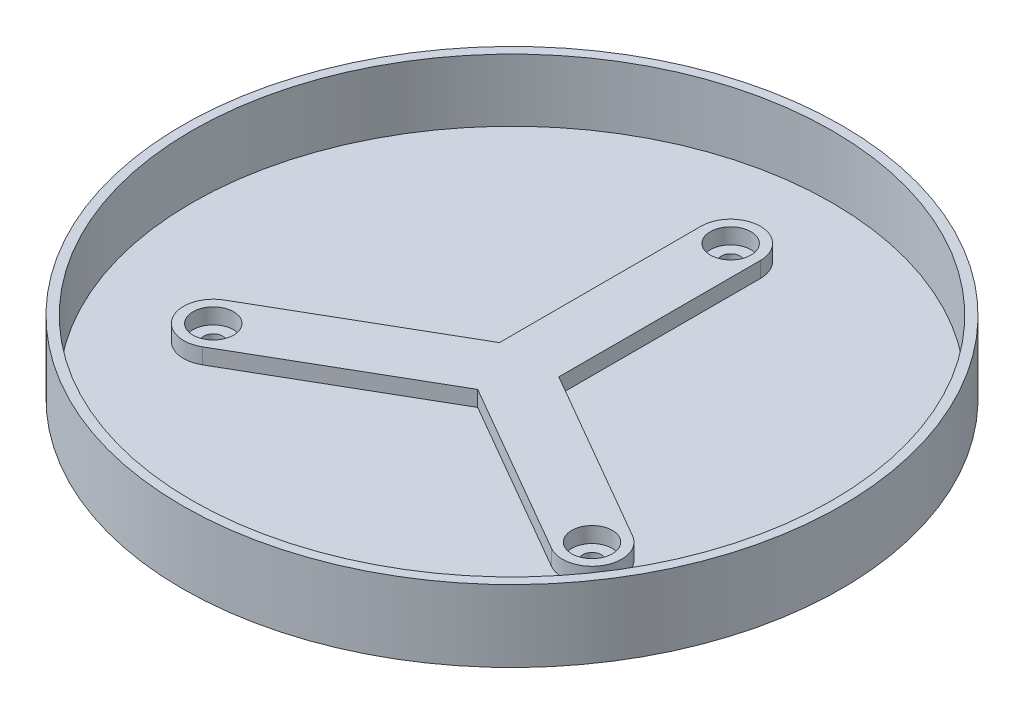
ISO-10303-21;
HEADER;
FILE_DESCRIPTION(('STEP AP214'),'2;1');
FILE_NAME('part.step','',(''),(''),'','','');
FILE_SCHEMA(('AUTOMOTIVE_DESIGN { 1 0 10303 214 1 1 1 1 }'));
ENDSEC;
DATA;
#1=APPLICATION_CONTEXT('core data for automotive mechanical design processes');
#2=APPLICATION_PROTOCOL_DEFINITION('international standard','automotive_design',2000,#1);
#3=PRODUCT_CONTEXT('',#1,'mechanical');
#4=PRODUCT('Part','Part','',(#3));
#5=PRODUCT_RELATED_PRODUCT_CATEGORY('part','',(#4));
#6=PRODUCT_DEFINITION_FORMATION('','',#4);
#7=PRODUCT_DEFINITION_CONTEXT('part definition',#1,'design');
#8=PRODUCT_DEFINITION('design','',#6,#7);
#9=PRODUCT_DEFINITION_SHAPE('','',#8);
#10=(LENGTH_UNIT() NAMED_UNIT(*) SI_UNIT(.MILLI.,.METRE.));
#11=(NAMED_UNIT(*) PLANE_ANGLE_UNIT() SI_UNIT($,.RADIAN.));
#12=(NAMED_UNIT(*) SI_UNIT($,.STERADIAN.) SOLID_ANGLE_UNIT());
#13=UNCERTAINTY_MEASURE_WITH_UNIT(LENGTH_MEASURE(1.E-05),#10,'distance_accuracy_value','');
#14=(GEOMETRIC_REPRESENTATION_CONTEXT(3) GLOBAL_UNCERTAINTY_ASSIGNED_CONTEXT((#13)) GLOBAL_UNIT_ASSIGNED_CONTEXT((#10,
#11,#12)) REPRESENTATION_CONTEXT('',''));
#15=CARTESIAN_POINT('',(0.,0.,0.));
#16=DIRECTION('',(0.,0.,1.));
#17=DIRECTION('',(1.,0.,0.));
#18=AXIS2_PLACEMENT_3D('',#15,#16,#17);
#19=CARTESIAN_POINT('',(0.,20.,0.));
#20=DIRECTION('',(0.,-1.,0.));
#21=DIRECTION('',(0.,0.,-1.));
#22=AXIS2_PLACEMENT_3D('',#19,#20,#21);
#23=CYLINDRICAL_SURFACE('',#22,105.5);
#24=CARTESIAN_POINT('',(0.,20.,0.));
#25=DIRECTION('',(0.,1.,0.));
#26=DIRECTION('',(0.,0.,1.));
#27=AXIS2_PLACEMENT_3D('',#24,#25,#26);
#28=CIRCLE('',#27,105.5);
#29=CARTESIAN_POINT('',(0.,20.,105.5));
#30=VERTEX_POINT('',#29);
#31=EDGE_CURVE('E193',#30,#30,#28,.T.);
#32=ORIENTED_EDGE('',*,*,#31,.F.);
#33=EDGE_LOOP('',(#32));
#34=FACE_BOUND('',#33,.T.);
#35=CARTESIAN_POINT('',(0.,-3.,0.));
#36=DIRECTION('',(0.,1.,0.));
#37=DIRECTION('',(0.,0.,1.));
#38=AXIS2_PLACEMENT_3D('',#35,#36,#37);
#39=CIRCLE('',#38,105.5);
#40=CARTESIAN_POINT('',(0.,-3.,105.5));
#41=VERTEX_POINT('',#40);
#42=EDGE_CURVE('E188',#41,#41,#39,.T.);
#43=ORIENTED_EDGE('',*,*,#42,.T.);
#44=EDGE_LOOP('',(#43));
#45=FACE_BOUND('',#44,.T.);
#46=ADVANCED_FACE('F35',(#34,#45),#23,.T.);
#47=CARTESIAN_POINT('',(0.,20.,0.));
#48=DIRECTION('',(0.,1.,0.));
#49=DIRECTION('',(0.,0.,1.));
#50=AXIS2_PLACEMENT_3D('',#47,#48,#49);
#51=PLANE('',#50);
#52=CARTESIAN_POINT('',(0.,20.,0.));
#53=DIRECTION('',(0.,1.,0.));
#54=DIRECTION('',(0.,0.,1.));
#55=AXIS2_PLACEMENT_3D('',#52,#53,#54);
#56=CIRCLE('',#55,102.5);
#57=CARTESIAN_POINT('',(0.,20.,102.5));
#58=VERTEX_POINT('',#57);
#59=EDGE_CURVE('E185',#58,#58,#56,.T.);
#60=ORIENTED_EDGE('',*,*,#59,.F.);
#61=EDGE_LOOP('',(#60));
#62=FACE_BOUND('',#61,.T.);
#63=ORIENTED_EDGE('',*,*,#31,.T.);
#64=EDGE_LOOP('',(#63));
#65=FACE_BOUND('',#64,.T.);
#66=ADVANCED_FACE('F236',(#62,#65),#51,.T.);
#67=CARTESIAN_POINT('',(0.,-3.,0.));
#68=DIRECTION('',(0.,1.,0.));
#69=DIRECTION('',(0.,0.,1.));
#70=AXIS2_PLACEMENT_3D('',#67,#68,#69);
#71=PLANE('',#70);
#72=CARTESIAN_POINT('',(0.,-3.,-70.));
#73=DIRECTION('',(0.,1.,0.));
#74=DIRECTION('',(0.,0.,1.));
#75=AXIS2_PLACEMENT_3D('',#72,#73,#74);
#76=CIRCLE('',#75,3.);
#77=CARTESIAN_POINT('',(0.,-3.,-67.));
#78=VERTEX_POINT('',#77);
#79=EDGE_CURVE('E204',#78,#78,#76,.T.);
#80=ORIENTED_EDGE('',*,*,#79,.T.);
#81=EDGE_LOOP('',(#80));
#82=FACE_BOUND('',#81,.T.);
#83=CARTESIAN_POINT('',(60.6217782649152,-3.,34.9999999999974));
#84=DIRECTION('',(0.,1.,0.));
#85=DIRECTION('',(0.,0.,1.));
#86=AXIS2_PLACEMENT_3D('',#83,#84,#85);
#87=CIRCLE('',#86,3.00000000000382);
#88=CARTESIAN_POINT('',(60.6217782649152,-3.,38.0000000000013));
#89=VERTEX_POINT('',#88);
#90=EDGE_CURVE('E306',#89,#89,#87,.T.);
#91=ORIENTED_EDGE('',*,*,#90,.T.);
#92=EDGE_LOOP('',(#91));
#93=FACE_BOUND('',#92,.T.);
#94=CARTESIAN_POINT('',(-60.6217782649063,-3.,35.0000000000026));
#95=DIRECTION('',(0.,1.,0.));
#96=DIRECTION('',(0.,0.,1.));
#97=AXIS2_PLACEMENT_3D('',#94,#95,#96);
#98=CIRCLE('',#97,3.00000000000564);
#99=CARTESIAN_POINT('',(-60.6217782649063,-3.,38.0000000000082));
#100=VERTEX_POINT('',#99);
#101=EDGE_CURVE('E308',#100,#100,#98,.T.);
#102=ORIENTED_EDGE('',*,*,#101,.T.);
#103=EDGE_LOOP('',(#102));
#104=FACE_BOUND('',#103,.T.);
#105=ORIENTED_EDGE('',*,*,#42,.F.);
#106=EDGE_LOOP('',(#105));
#107=FACE_BOUND('',#106,.T.);
#108=ADVANCED_FACE('F37',(#82,#93,#104,#107),#71,.F.);
#109=CARTESIAN_POINT('',(0.,20.,0.));
#110=DIRECTION('',(0.,-1.,0.));
#111=DIRECTION('',(0.,0.,-1.));
#112=AXIS2_PLACEMENT_3D('',#109,#110,#111);
#113=CYLINDRICAL_SURFACE('',#112,102.5);
#114=ORIENTED_EDGE('',*,*,#59,.T.);
#115=EDGE_LOOP('',(#114));
#116=FACE_BOUND('',#115,.T.);
#117=CARTESIAN_POINT('',(0.,0.,0.));
#118=DIRECTION('',(0.,1.,0.));
#119=DIRECTION('',(0.,0.,1.));
#120=AXIS2_PLACEMENT_3D('',#117,#118,#119);
#121=CIRCLE('',#120,102.5);
#122=CARTESIAN_POINT('',(0.,0.,102.5));
#123=VERTEX_POINT('',#122);
#124=EDGE_CURVE('E184',#123,#123,#121,.T.);
#125=ORIENTED_EDGE('',*,*,#124,.F.);
#126=EDGE_LOOP('',(#125));
#127=FACE_BOUND('',#126,.T.);
#128=ADVANCED_FACE('F246',(#116,#127),#113,.F.);
#129=CARTESIAN_POINT('',(0.,0.,0.));
#130=DIRECTION('',(0.,1.,0.));
#131=DIRECTION('',(0.,0.,1.));
#132=AXIS2_PLACEMENT_3D('',#129,#130,#131);
#133=PLANE('',#132);
#134=DIRECTION('',(0.866025403784436,0.,0.500000000000004));
#135=VECTOR('',#134,1.);
#136=CARTESIAN_POINT('',(-4.75000000000003,0.,8.22724133595214));
#137=LINE('',#136,#135);
#138=CARTESIAN_POINT('',(0.,0.,10.9696551146029));
#139=VERTEX_POINT('',#138);
#140=CARTESIAN_POINT('',(55.8717782649105,0.,43.2272413359524));
#141=VERTEX_POINT('',#140);
#142=EDGE_CURVE('E152',#139,#141,#137,.T.);
#143=ORIENTED_EDGE('',*,*,#142,.F.);
#144=DIRECTION('',(0.866025403784443,0.,-0.499999999999992));
#145=VECTOR('',#144,1.);
#146=CARTESIAN_POINT('',(4.74999999999992,0.,8.2272413359522));
#147=LINE('',#146,#145);
#148=CARTESIAN_POINT('',(-55.8717782649111,0.,43.2272413359516));
#149=VERTEX_POINT('',#148);
#150=EDGE_CURVE('E149',#149,#139,#147,.T.);
#151=ORIENTED_EDGE('',*,*,#150,.F.);
#152=CARTESIAN_POINT('',(-60.621778264911,0.,34.9999999999994));
#153=DIRECTION('',(0.,1.,0.));
#154=DIRECTION('',(0.,0.,1.));
#155=AXIS2_PLACEMENT_3D('',#152,#153,#154);
#156=CIRCLE('',#155,9.49999999999999);
#157=CARTESIAN_POINT('',(-65.371778264911,0.,26.7727586640472));
#158=VERTEX_POINT('',#157);
#159=EDGE_CURVE('E89',#158,#149,#156,.T.);
#160=ORIENTED_EDGE('',*,*,#159,.F.);
#161=DIRECTION('',(-0.866025403784443,0.,0.499999999999992));
#162=VECTOR('',#161,1.);
#163=CARTESIAN_POINT('',(-4.74999999999992,0.,-8.2272413359522));
#164=LINE('',#163,#162);
#165=CARTESIAN_POINT('',(-9.49999999999999,0.,-5.48482755730149));
#166=VERTEX_POINT('',#165);
#167=EDGE_CURVE('E163',#166,#158,#164,.T.);
#168=ORIENTED_EDGE('',*,*,#167,.F.);
#169=DIRECTION('',(0.,0.,1.));
#170=VECTOR('',#169,1.);
#171=CARTESIAN_POINT('',(-9.49999999999999,0.,0.));
#172=LINE('',#171,#170);
#173=CARTESIAN_POINT('',(-9.49999999999999,0.,-70.));
#174=VERTEX_POINT('',#173);
#175=EDGE_CURVE('E129',#174,#166,#172,.T.);
#176=ORIENTED_EDGE('',*,*,#175,.F.);
#177=CARTESIAN_POINT('',(0.,0.,-70.));
#178=DIRECTION('',(0.,1.,0.));
#179=DIRECTION('',(0.,0.,1.));
#180=AXIS2_PLACEMENT_3D('',#177,#178,#179);
#181=CIRCLE('',#180,9.49999999999999);
#182=CARTESIAN_POINT('',(9.49999999999999,0.,-70.));
#183=VERTEX_POINT('',#182);
#184=EDGE_CURVE('E160',#183,#174,#181,.T.);
#185=ORIENTED_EDGE('',*,*,#184,.F.);
#186=DIRECTION('',(0.,0.,-1.));
#187=VECTOR('',#186,1.);
#188=CARTESIAN_POINT('',(9.49999999999999,0.,0.));
#189=LINE('',#188,#187);
#190=CARTESIAN_POINT('',(9.49999999999999,0.,-5.48482755730141));
#191=VERTEX_POINT('',#190);
#192=EDGE_CURVE('E158',#191,#183,#189,.T.);
#193=ORIENTED_EDGE('',*,*,#192,.F.);
#194=DIRECTION('',(-0.866025403784436,0.,-0.500000000000004));
#195=VECTOR('',#194,1.);
#196=CARTESIAN_POINT('',(4.75000000000003,0.,-8.22724133595213));
#197=LINE('',#196,#195);
#198=CARTESIAN_POINT('',(65.3717782649106,0.,26.7727586640482));
#199=VERTEX_POINT('',#198);
#200=EDGE_CURVE('E156',#199,#191,#197,.T.);
#201=ORIENTED_EDGE('',*,*,#200,.F.);
#202=CARTESIAN_POINT('',(60.6217782649106,0.,35.0000000000003));
#203=DIRECTION('',(0.,1.,0.));
#204=DIRECTION('',(0.,0.,1.));
#205=AXIS2_PLACEMENT_3D('',#202,#203,#204);
#206=CIRCLE('',#205,9.49999999999999);
#207=EDGE_CURVE('E154',#141,#199,#206,.T.);
#208=ORIENTED_EDGE('',*,*,#207,.F.);
#209=EDGE_LOOP('',(#143,#151,#160,#168,#176,#185,#193,#201,#208));
#210=FACE_BOUND('',#209,.T.);
#211=ORIENTED_EDGE('',*,*,#124,.T.);
#212=EDGE_LOOP('',(#211));
#213=FACE_BOUND('',#212,.T.);
#214=ADVANCED_FACE('F219',(#210,#213),#133,.T.);
#215=CARTESIAN_POINT('',(4.74999999999992,5.,8.2272413359522));
#216=DIRECTION('',(-0.499999999999992,0.,-0.866025403784443));
#217=DIRECTION('',(-0.866025403784443,0.,0.499999999999992));
#218=AXIS2_PLACEMENT_3D('',#215,#216,#217);
#219=PLANE('',#218);
#220=ORIENTED_EDGE('',*,*,#150,.T.);
#221=DIRECTION('',(0.,-1.,0.));
#222=VECTOR('',#221,1.);
#223=CARTESIAN_POINT('',(0.,5.,10.9696551146029));
#224=LINE('',#223,#222);
#225=CARTESIAN_POINT('',(0.,5.,10.9696551146029));
#226=VERTEX_POINT('',#225);
#227=EDGE_CURVE('E182',#226,#139,#224,.T.);
#228=ORIENTED_EDGE('',*,*,#227,.F.);
#229=DIRECTION('',(0.866025403784443,0.,-0.499999999999992));
#230=VECTOR('',#229,1.);
#231=CARTESIAN_POINT('',(4.74999999999992,5.,8.2272413359522));
#232=LINE('',#231,#230);
#233=CARTESIAN_POINT('',(-55.8717782649111,5.,43.2272413359516));
#234=VERTEX_POINT('',#233);
#235=EDGE_CURVE('E166',#234,#226,#232,.T.);
#236=ORIENTED_EDGE('',*,*,#235,.F.);
#237=DIRECTION('',(0.,-1.,0.));
#238=VECTOR('',#237,1.);
#239=CARTESIAN_POINT('',(-55.8717782649111,5.,43.2272413359516));
#240=LINE('',#239,#238);
#241=EDGE_CURVE('E148',#234,#149,#240,.T.);
#242=ORIENTED_EDGE('',*,*,#241,.T.);
#243=EDGE_LOOP('',(#220,#228,#236,#242));
#244=FACE_BOUND('',#243,.T.);
#245=ADVANCED_FACE('F251',(#244),#219,.F.);
#246=CARTESIAN_POINT('',(-4.75000000000003,5.,8.22724133595214));
#247=DIRECTION('',(0.500000000000004,0.,-0.866025403784436));
#248=DIRECTION('',(-0.866025403784436,0.,-0.500000000000004));
#249=AXIS2_PLACEMENT_3D('',#246,#247,#248);
#250=PLANE('',#249);
#251=ORIENTED_EDGE('',*,*,#142,.T.);
#252=DIRECTION('',(0.,-1.,0.));
#253=VECTOR('',#252,1.);
#254=CARTESIAN_POINT('',(55.8717782649105,5.,43.2272413359524));
#255=LINE('',#254,#253);
#256=CARTESIAN_POINT('',(55.8717782649105,5.,43.2272413359524));
#257=VERTEX_POINT('',#256);
#258=EDGE_CURVE('E179',#257,#141,#255,.T.);
#259=ORIENTED_EDGE('',*,*,#258,.F.);
#260=DIRECTION('',(0.866025403784436,0.,0.500000000000004));
#261=VECTOR('',#260,1.);
#262=CARTESIAN_POINT('',(-4.75000000000003,5.,8.22724133595214));
#263=LINE('',#262,#261);
#264=EDGE_CURVE('E97',#226,#257,#263,.T.);
#265=ORIENTED_EDGE('',*,*,#264,.F.);
#266=ORIENTED_EDGE('',*,*,#227,.T.);
#267=EDGE_LOOP('',(#251,#259,#265,#266));
#268=FACE_BOUND('',#267,.T.);
#269=ADVANCED_FACE('F256',(#268),#250,.F.);
#270=CARTESIAN_POINT('',(60.6217782649106,5.,35.0000000000003));
#271=DIRECTION('',(0.,-1.,0.));
#272=DIRECTION('',(0.,0.,-1.));
#273=AXIS2_PLACEMENT_3D('',#270,#271,#272);
#274=CYLINDRICAL_SURFACE('',#273,9.49999999999999);
#275=ORIENTED_EDGE('',*,*,#207,.T.);
#276=DIRECTION('',(0.,-1.,0.));
#277=VECTOR('',#276,1.);
#278=CARTESIAN_POINT('',(65.3717782649106,5.,26.7727586640482));
#279=LINE('',#278,#277);
#280=CARTESIAN_POINT('',(65.3717782649106,5.,26.7727586640482));
#281=VERTEX_POINT('',#280);
#282=EDGE_CURVE('E176',#281,#199,#279,.T.);
#283=ORIENTED_EDGE('',*,*,#282,.F.);
#284=CARTESIAN_POINT('',(60.6217782649106,5.,35.0000000000003));
#285=DIRECTION('',(0.,1.,0.));
#286=DIRECTION('',(0.,0.,1.));
#287=AXIS2_PLACEMENT_3D('',#284,#285,#286);
#288=CIRCLE('',#287,9.49999999999999);
#289=EDGE_CURVE('E317',#257,#281,#288,.T.);
#290=ORIENTED_EDGE('',*,*,#289,.F.);
#291=ORIENTED_EDGE('',*,*,#258,.T.);
#292=EDGE_LOOP('',(#275,#283,#290,#291));
#293=FACE_BOUND('',#292,.T.);
#294=ADVANCED_FACE('F260',(#293),#274,.T.);
#295=CARTESIAN_POINT('',(4.75000000000003,5.,-8.22724133595213));
#296=DIRECTION('',(-0.500000000000004,0.,0.866025403784436));
#297=DIRECTION('',(0.866025403784436,0.,0.500000000000004));
#298=AXIS2_PLACEMENT_3D('',#295,#296,#297);
#299=PLANE('',#298);
#300=ORIENTED_EDGE('',*,*,#200,.T.);
#301=DIRECTION('',(0.,-1.,0.));
#302=VECTOR('',#301,1.);
#303=CARTESIAN_POINT('',(9.49999999999999,5.,-5.48482755730141));
#304=LINE('',#303,#302);
#305=CARTESIAN_POINT('',(9.49999999999999,5.,-5.48482755730141));
#306=VERTEX_POINT('',#305);
#307=EDGE_CURVE('E173',#306,#191,#304,.T.);
#308=ORIENTED_EDGE('',*,*,#307,.F.);
#309=DIRECTION('',(-0.866025403784436,0.,-0.500000000000004));
#310=VECTOR('',#309,1.);
#311=CARTESIAN_POINT('',(4.75000000000003,5.,-8.22724133595213));
#312=LINE('',#311,#310);
#313=EDGE_CURVE('E319',#281,#306,#312,.T.);
#314=ORIENTED_EDGE('',*,*,#313,.F.);
#315=ORIENTED_EDGE('',*,*,#282,.T.);
#316=EDGE_LOOP('',(#300,#308,#314,#315));
#317=FACE_BOUND('',#316,.T.);
#318=ADVANCED_FACE('F263',(#317),#299,.F.);
#319=CARTESIAN_POINT('',(9.49999999999999,5.,0.));
#320=DIRECTION('',(-1.,0.,0.));
#321=DIRECTION('',(0.,0.,1.));
#322=AXIS2_PLACEMENT_3D('',#319,#320,#321);
#323=PLANE('',#322);
#324=ORIENTED_EDGE('',*,*,#192,.T.);
#325=DIRECTION('',(0.,-1.,0.));
#326=VECTOR('',#325,1.);
#327=CARTESIAN_POINT('',(9.49999999999999,5.,-70.));
#328=LINE('',#327,#326);
#329=CARTESIAN_POINT('',(9.49999999999999,5.,-70.));
#330=VERTEX_POINT('',#329);
#331=EDGE_CURVE('E170',#330,#183,#328,.T.);
#332=ORIENTED_EDGE('',*,*,#331,.F.);
#333=DIRECTION('',(0.,0.,-1.));
#334=VECTOR('',#333,1.);
#335=CARTESIAN_POINT('',(9.49999999999999,5.,0.));
#336=LINE('',#335,#334);
#337=EDGE_CURVE('E321',#306,#330,#336,.T.);
#338=ORIENTED_EDGE('',*,*,#337,.F.);
#339=ORIENTED_EDGE('',*,*,#307,.T.);
#340=EDGE_LOOP('',(#324,#332,#338,#339));
#341=FACE_BOUND('',#340,.T.);
#342=ADVANCED_FACE('F267',(#341),#323,.F.);
#343=CARTESIAN_POINT('',(0.,5.,-70.));
#344=DIRECTION('',(0.,-1.,0.));
#345=DIRECTION('',(0.,0.,-1.));
#346=AXIS2_PLACEMENT_3D('',#343,#344,#345);
#347=CYLINDRICAL_SURFACE('',#346,9.49999999999999);
#348=ORIENTED_EDGE('',*,*,#184,.T.);
#349=DIRECTION('',(0.,-1.,0.));
#350=VECTOR('',#349,1.);
#351=CARTESIAN_POINT('',(-9.49999999999999,5.,-70.));
#352=LINE('',#351,#350);
#353=CARTESIAN_POINT('',(-9.49999999999999,5.,-70.));
#354=VERTEX_POINT('',#353);
#355=EDGE_CURVE('E132',#354,#174,#352,.T.);
#356=ORIENTED_EDGE('',*,*,#355,.F.);
#357=CARTESIAN_POINT('',(0.,5.,-70.));
#358=DIRECTION('',(0.,1.,0.));
#359=DIRECTION('',(0.,0.,1.));
#360=AXIS2_PLACEMENT_3D('',#357,#358,#359);
#361=CIRCLE('',#360,9.49999999999999);
#362=EDGE_CURVE('E120',#330,#354,#361,.T.);
#363=ORIENTED_EDGE('',*,*,#362,.F.);
#364=ORIENTED_EDGE('',*,*,#331,.T.);
#365=EDGE_LOOP('',(#348,#356,#363,#364));
#366=FACE_BOUND('',#365,.T.);
#367=ADVANCED_FACE('F271',(#366),#347,.T.);
#368=CARTESIAN_POINT('',(-9.49999999999999,5.,0.));
#369=DIRECTION('',(1.,0.,0.));
#370=DIRECTION('',(0.,0.,-1.));
#371=AXIS2_PLACEMENT_3D('',#368,#369,#370);
#372=PLANE('',#371);
#373=ORIENTED_EDGE('',*,*,#175,.T.);
#374=DIRECTION('',(0.,-1.,0.));
#375=VECTOR('',#374,1.);
#376=CARTESIAN_POINT('',(-9.49999999999999,5.,-5.48482755730149));
#377=LINE('',#376,#375);
#378=CARTESIAN_POINT('',(-9.49999999999999,5.,-5.48482755730149));
#379=VERTEX_POINT('',#378);
#380=EDGE_CURVE('E126',#379,#166,#377,.T.);
#381=ORIENTED_EDGE('',*,*,#380,.F.);
#382=DIRECTION('',(0.,0.,1.));
#383=VECTOR('',#382,1.);
#384=CARTESIAN_POINT('',(-9.49999999999999,5.,0.));
#385=LINE('',#384,#383);
#386=EDGE_CURVE('E113',#354,#379,#385,.T.);
#387=ORIENTED_EDGE('',*,*,#386,.F.);
#388=ORIENTED_EDGE('',*,*,#355,.T.);
#389=EDGE_LOOP('',(#373,#381,#387,#388));
#390=FACE_BOUND('',#389,.T.);
#391=ADVANCED_FACE('F127',(#390),#372,.F.);
#392=CARTESIAN_POINT('',(-4.74999999999992,5.,-8.2272413359522));
#393=DIRECTION('',(0.499999999999992,0.,0.866025403784443));
#394=DIRECTION('',(0.866025403784443,0.,-0.499999999999992));
#395=AXIS2_PLACEMENT_3D('',#392,#393,#394);
#396=PLANE('',#395);
#397=ORIENTED_EDGE('',*,*,#167,.T.);
#398=DIRECTION('',(0.,-1.,0.));
#399=VECTOR('',#398,1.);
#400=CARTESIAN_POINT('',(-65.371778264911,5.,26.7727586640472));
#401=LINE('',#400,#399);
#402=CARTESIAN_POINT('',(-65.371778264911,5.,26.7727586640472));
#403=VERTEX_POINT('',#402);
#404=EDGE_CURVE('E52',#403,#158,#401,.T.);
#405=ORIENTED_EDGE('',*,*,#404,.F.);
#406=DIRECTION('',(-0.866025403784443,0.,0.499999999999992));
#407=VECTOR('',#406,1.);
#408=CARTESIAN_POINT('',(-4.74999999999992,5.,-8.2272413359522));
#409=LINE('',#408,#407);
#410=EDGE_CURVE('E118',#379,#403,#409,.T.);
#411=ORIENTED_EDGE('',*,*,#410,.F.);
#412=ORIENTED_EDGE('',*,*,#380,.T.);
#413=EDGE_LOOP('',(#397,#405,#411,#412));
#414=FACE_BOUND('',#413,.T.);
#415=ADVANCED_FACE('F134',(#414),#396,.F.);
#416=CARTESIAN_POINT('',(60.6217782649106,5.,35.0000000000003));
#417=DIRECTION('',(0.,-1.,0.));
#418=DIRECTION('',(0.,0.,-1.));
#419=AXIS2_PLACEMENT_3D('',#416,#417,#418);
#420=CYLINDRICAL_SURFACE('',#419,6.5);
#421=CARTESIAN_POINT('',(60.6217782649106,5.,35.0000000000003));
#422=DIRECTION('',(0.,1.,0.));
#423=DIRECTION('',(0.,0.,1.));
#424=AXIS2_PLACEMENT_3D('',#421,#422,#423);
#425=CIRCLE('',#424,6.5);
#426=CARTESIAN_POINT('',(60.6217782649106,5.,41.5000000000003));
#427=VERTEX_POINT('',#426);
#428=EDGE_CURVE('E142',#427,#427,#425,.T.);
#429=ORIENTED_EDGE('',*,*,#428,.T.);
#430=EDGE_LOOP('',(#429));
#431=FACE_BOUND('',#430,.T.);
#432=CARTESIAN_POINT('',(60.6217782649106,0.,35.0000000000003));
#433=DIRECTION('',(0.,1.,0.));
#434=DIRECTION('',(0.,0.,1.));
#435=AXIS2_PLACEMENT_3D('',#432,#433,#434);
#436=CIRCLE('',#435,6.5);
#437=CARTESIAN_POINT('',(60.6217782649106,0.,41.5000000000003));
#438=VERTEX_POINT('',#437);
#439=EDGE_CURVE('E11',#438,#438,#436,.F.);
#440=ORIENTED_EDGE('',*,*,#439,.T.);
#441=EDGE_LOOP('',(#440));
#442=FACE_BOUND('',#441,.T.);
#443=ADVANCED_FACE('F279',(#431,#442),#420,.F.);
#444=CARTESIAN_POINT('',(0.,5.,-70.));
#445=DIRECTION('',(0.,-1.,0.));
#446=DIRECTION('',(0.,0.,-1.));
#447=AXIS2_PLACEMENT_3D('',#444,#445,#446);
#448=CYLINDRICAL_SURFACE('',#447,6.5);
#449=CARTESIAN_POINT('',(0.,5.,-70.));
#450=DIRECTION('',(0.,1.,0.));
#451=DIRECTION('',(0.,0.,1.));
#452=AXIS2_PLACEMENT_3D('',#449,#450,#451);
#453=CIRCLE('',#452,6.5);
#454=CARTESIAN_POINT('',(0.,5.,-63.5));
#455=VERTEX_POINT('',#454);
#456=EDGE_CURVE('E136',#455,#455,#453,.T.);
#457=ORIENTED_EDGE('',*,*,#456,.T.);
#458=EDGE_LOOP('',(#457));
#459=FACE_BOUND('',#458,.T.);
#460=CARTESIAN_POINT('',(0.,0.,-70.));
#461=DIRECTION('',(0.,1.,0.));
#462=DIRECTION('',(0.,0.,1.));
#463=AXIS2_PLACEMENT_3D('',#460,#461,#462);
#464=CIRCLE('',#463,6.5);
#465=CARTESIAN_POINT('',(0.,0.,-63.5));
#466=VERTEX_POINT('',#465);
#467=EDGE_CURVE('E44',#466,#466,#464,.F.);
#468=ORIENTED_EDGE('',*,*,#467,.T.);
#469=EDGE_LOOP('',(#468));
#470=FACE_BOUND('',#469,.T.);
#471=ADVANCED_FACE('F232',(#459,#470),#448,.F.);
#472=CARTESIAN_POINT('',(-60.621778264911,5.,34.9999999999994));
#473=DIRECTION('',(0.,-1.,0.));
#474=DIRECTION('',(0.,0.,-1.));
#475=AXIS2_PLACEMENT_3D('',#472,#473,#474);
#476=CYLINDRICAL_SURFACE('',#475,9.49999999999999);
#477=ORIENTED_EDGE('',*,*,#159,.T.);
#478=ORIENTED_EDGE('',*,*,#241,.F.);
#479=CARTESIAN_POINT('',(-60.621778264911,5.,34.9999999999994));
#480=DIRECTION('',(0.,1.,0.));
#481=DIRECTION('',(0.,0.,1.));
#482=AXIS2_PLACEMENT_3D('',#479,#480,#481);
#483=CIRCLE('',#482,9.49999999999999);
#484=EDGE_CURVE('E60',#403,#234,#483,.T.);
#485=ORIENTED_EDGE('',*,*,#484,.F.);
#486=ORIENTED_EDGE('',*,*,#404,.T.);
#487=EDGE_LOOP('',(#477,#478,#485,#486));
#488=FACE_BOUND('',#487,.T.);
#489=ADVANCED_FACE('F224',(#488),#476,.T.);
#490=CARTESIAN_POINT('',(-60.621778264911,5.,34.9999999999994));
#491=DIRECTION('',(0.,-1.,0.));
#492=DIRECTION('',(0.,0.,-1.));
#493=AXIS2_PLACEMENT_3D('',#490,#491,#492);
#494=CYLINDRICAL_SURFACE('',#493,6.5);
#495=CARTESIAN_POINT('',(-60.621778264911,5.,34.9999999999994));
#496=DIRECTION('',(0.,1.,0.));
#497=DIRECTION('',(0.,0.,1.));
#498=AXIS2_PLACEMENT_3D('',#495,#496,#497);
#499=CIRCLE('',#498,6.5);
#500=CARTESIAN_POINT('',(-60.621778264911,5.,41.4999999999994));
#501=VERTEX_POINT('',#500);
#502=EDGE_CURVE('E145',#501,#501,#499,.T.);
#503=ORIENTED_EDGE('',*,*,#502,.T.);
#504=EDGE_LOOP('',(#503));
#505=FACE_BOUND('',#504,.T.);
#506=CARTESIAN_POINT('',(-60.621778264911,0.,34.9999999999994));
#507=DIRECTION('',(0.,1.,0.));
#508=DIRECTION('',(0.,0.,1.));
#509=AXIS2_PLACEMENT_3D('',#506,#507,#508);
#510=CIRCLE('',#509,6.5);
#511=CARTESIAN_POINT('',(-60.621778264911,0.,41.4999999999994));
#512=VERTEX_POINT('',#511);
#513=EDGE_CURVE('E196',#512,#512,#510,.F.);
#514=ORIENTED_EDGE('',*,*,#513,.T.);
#515=EDGE_LOOP('',(#514));
#516=FACE_BOUND('',#515,.T.);
#517=ADVANCED_FACE('F222',(#505,#516),#494,.F.);
#518=CARTESIAN_POINT('',(0.,5.,0.));
#519=DIRECTION('',(0.,1.,0.));
#520=DIRECTION('',(0.,0.,1.));
#521=AXIS2_PLACEMENT_3D('',#518,#519,#520);
#522=PLANE('',#521);
#523=ORIENTED_EDGE('',*,*,#235,.T.);
#524=ORIENTED_EDGE('',*,*,#264,.T.);
#525=ORIENTED_EDGE('',*,*,#289,.T.);
#526=ORIENTED_EDGE('',*,*,#313,.T.);
#527=ORIENTED_EDGE('',*,*,#337,.T.);
#528=ORIENTED_EDGE('',*,*,#362,.T.);
#529=ORIENTED_EDGE('',*,*,#386,.T.);
#530=ORIENTED_EDGE('',*,*,#410,.T.);
#531=ORIENTED_EDGE('',*,*,#484,.T.);
#532=EDGE_LOOP('',(#523,#524,#525,#526,#527,#528,#529,#530,#531));
#533=FACE_BOUND('',#532,.T.);
#534=ORIENTED_EDGE('',*,*,#456,.F.);
#535=EDGE_LOOP('',(#534));
#536=FACE_BOUND('',#535,.T.);
#537=ORIENTED_EDGE('',*,*,#428,.F.);
#538=EDGE_LOOP('',(#537));
#539=FACE_BOUND('',#538,.T.);
#540=ORIENTED_EDGE('',*,*,#502,.F.);
#541=EDGE_LOOP('',(#540));
#542=FACE_BOUND('',#541,.T.);
#543=ADVANCED_FACE('F115',(#533,#536,#539,#542),#522,.T.);
#544=CARTESIAN_POINT('',(-60.6217782649063,0.,35.0000000000026));
#545=DIRECTION('',(0.,1.,0.));
#546=DIRECTION('',(0.,0.,1.));
#547=AXIS2_PLACEMENT_3D('',#544,#545,#546);
#548=CIRCLE('',#547,3.00000000000564);
#549=CARTESIAN_POINT('',(-60.6217782649063,0.,38.0000000000082));
#550=VERTEX_POINT('',#549);
#551=EDGE_CURVE('E39',#550,#550,#548,.T.);
#552=ORIENTED_EDGE('',*,*,#551,.F.);
#553=EDGE_LOOP('',(#552));
#554=FACE_BOUND('',#553,.T.);
#555=ORIENTED_EDGE('',*,*,#513,.F.);
#556=EDGE_LOOP('',(#555));
#557=FACE_BOUND('',#556,.T.);
#558=ADVANCED_FACE('F214',(#554,#557),#133,.T.);
#559=CARTESIAN_POINT('',(0.,0.,-70.));
#560=DIRECTION('',(0.,1.,0.));
#561=DIRECTION('',(0.,0.,1.));
#562=AXIS2_PLACEMENT_3D('',#559,#560,#561);
#563=CIRCLE('',#562,3.);
#564=CARTESIAN_POINT('',(0.,0.,-67.));
#565=VERTEX_POINT('',#564);
#566=EDGE_CURVE('E203',#565,#565,#563,.T.);
#567=ORIENTED_EDGE('',*,*,#566,.F.);
#568=EDGE_LOOP('',(#567));
#569=FACE_BOUND('',#568,.T.);
#570=ORIENTED_EDGE('',*,*,#467,.F.);
#571=EDGE_LOOP('',(#570));
#572=FACE_BOUND('',#571,.T.);
#573=ADVANCED_FACE('F217',(#569,#572),#133,.T.);
#574=CARTESIAN_POINT('',(60.6217782649152,0.,34.9999999999974));
#575=DIRECTION('',(0.,1.,0.));
#576=DIRECTION('',(0.,0.,1.));
#577=AXIS2_PLACEMENT_3D('',#574,#575,#576);
#578=CIRCLE('',#577,3.00000000000382);
#579=CARTESIAN_POINT('',(60.6217782649152,0.,38.0000000000013));
#580=VERTEX_POINT('',#579);
#581=EDGE_CURVE('E201',#580,#580,#578,.T.);
#582=ORIENTED_EDGE('',*,*,#581,.F.);
#583=EDGE_LOOP('',(#582));
#584=FACE_BOUND('',#583,.T.);
#585=ORIENTED_EDGE('',*,*,#439,.F.);
#586=EDGE_LOOP('',(#585));
#587=FACE_BOUND('',#586,.T.);
#588=ADVANCED_FACE('F253',(#584,#587),#133,.T.);
#589=CARTESIAN_POINT('',(60.6217782649152,-3.,34.9999999999974));
#590=DIRECTION('',(0.,1.,0.));
#591=DIRECTION('',(0.,0.,1.));
#592=AXIS2_PLACEMENT_3D('',#589,#590,#591);
#593=CYLINDRICAL_SURFACE('',#592,3.00000000000382);
#594=ORIENTED_EDGE('',*,*,#581,.T.);
#595=EDGE_LOOP('',(#594));
#596=FACE_BOUND('',#595,.T.);
#597=ORIENTED_EDGE('',*,*,#90,.F.);
#598=EDGE_LOOP('',(#597));
#599=FACE_BOUND('',#598,.T.);
#600=ADVANCED_FACE('F292',(#596,#599),#593,.F.);
#601=CARTESIAN_POINT('',(0.,-3.,-70.));
#602=DIRECTION('',(0.,1.,0.));
#603=DIRECTION('',(0.,0.,1.));
#604=AXIS2_PLACEMENT_3D('',#601,#602,#603);
#605=CYLINDRICAL_SURFACE('',#604,3.);
#606=ORIENTED_EDGE('',*,*,#566,.T.);
#607=EDGE_LOOP('',(#606));
#608=FACE_BOUND('',#607,.T.);
#609=ORIENTED_EDGE('',*,*,#79,.F.);
#610=EDGE_LOOP('',(#609));
#611=FACE_BOUND('',#610,.T.);
#612=ADVANCED_FACE('F298',(#608,#611),#605,.F.);
#613=CARTESIAN_POINT('',(-60.6217782649063,-3.,35.0000000000026));
#614=DIRECTION('',(0.,1.,0.));
#615=DIRECTION('',(0.,0.,1.));
#616=AXIS2_PLACEMENT_3D('',#613,#614,#615);
#617=CYLINDRICAL_SURFACE('',#616,3.00000000000564);
#618=ORIENTED_EDGE('',*,*,#551,.T.);
#619=EDGE_LOOP('',(#618));
#620=FACE_BOUND('',#619,.T.);
#621=ORIENTED_EDGE('',*,*,#101,.F.);
#622=EDGE_LOOP('',(#621));
#623=FACE_BOUND('',#622,.T.);
#624=ADVANCED_FACE('F211',(#620,#623),#617,.F.);
#625=CLOSED_SHELL('',(#46,#66,#108,#128,#214,#245,#269,#294,#318,#342,#367,#391,#415,#443,#471,
#489,#517,#543,#558,#573,#588,#600,#612,#624));
#626=MANIFOLD_SOLID_BREP('B2',#625);
#627=ADVANCED_BREP_SHAPE_REPRESENTATION('',(#18,#626),#14);
#628=SHAPE_DEFINITION_REPRESENTATION(#9,#627);
ENDSEC;
END-ISO-10303-21;
